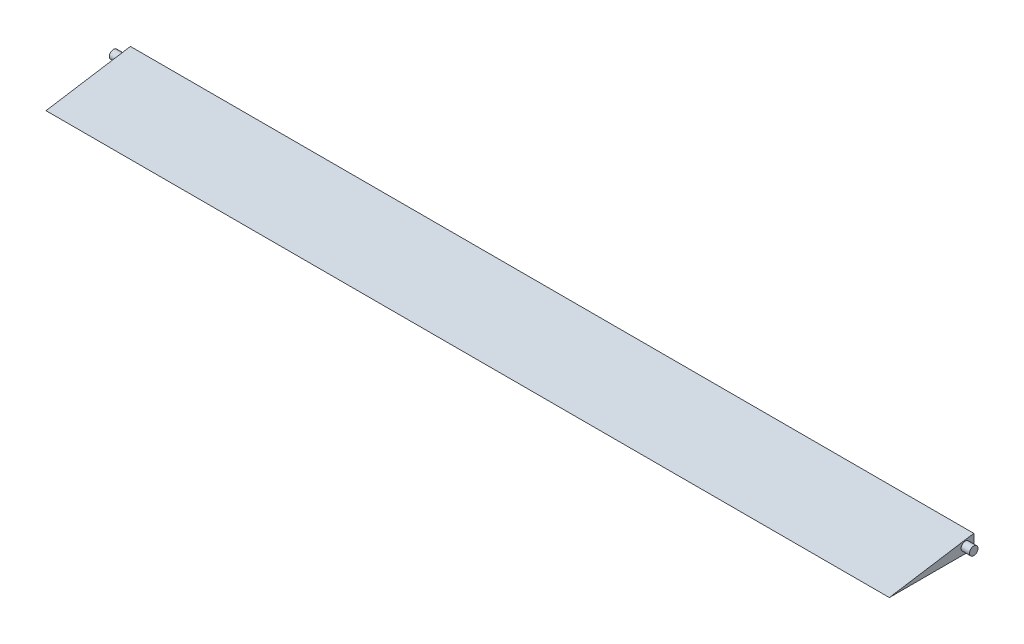
ISO-10303-21;
HEADER;
FILE_DESCRIPTION(('STEP AP214'),'2;1');
FILE_NAME('part.step','',(''),(''),'','','');
FILE_SCHEMA(('AUTOMOTIVE_DESIGN { 1 0 10303 214 1 1 1 1 }'));
ENDSEC;
DATA;
#1=APPLICATION_CONTEXT('core data for automotive mechanical design processes');
#2=APPLICATION_PROTOCOL_DEFINITION('international standard','automotive_design',2000,#1);
#3=PRODUCT_CONTEXT('',#1,'mechanical');
#4=PRODUCT('Part','Part','',(#3));
#5=PRODUCT_RELATED_PRODUCT_CATEGORY('part','',(#4));
#6=PRODUCT_DEFINITION_FORMATION('','',#4);
#7=PRODUCT_DEFINITION_CONTEXT('part definition',#1,'design');
#8=PRODUCT_DEFINITION('design','',#6,#7);
#9=PRODUCT_DEFINITION_SHAPE('','',#8);
#10=(LENGTH_UNIT() NAMED_UNIT(*) SI_UNIT(.MILLI.,.METRE.));
#11=(NAMED_UNIT(*) PLANE_ANGLE_UNIT() SI_UNIT($,.RADIAN.));
#12=(NAMED_UNIT(*) SI_UNIT($,.STERADIAN.) SOLID_ANGLE_UNIT());
#13=UNCERTAINTY_MEASURE_WITH_UNIT(LENGTH_MEASURE(1.E-05),#10,'distance_accuracy_value','');
#14=(GEOMETRIC_REPRESENTATION_CONTEXT(3) GLOBAL_UNCERTAINTY_ASSIGNED_CONTEXT((#13)) GLOBAL_UNIT_ASSIGNED_CONTEXT((#10,
#11,#12)) REPRESENTATION_CONTEXT('',''));
#15=CARTESIAN_POINT('',(0.,0.,0.));
#16=DIRECTION('',(0.,0.,1.));
#17=DIRECTION('',(1.,0.,0.));
#18=AXIS2_PLACEMENT_3D('',#15,#16,#17);
#19=CARTESIAN_POINT('',(499.5,0.,25.));
#20=DIRECTION('',(0.,-0.987563584303809,-0.157220122621166));
#21=DIRECTION('',(0.,0.157220122621166,-0.987563584303809));
#22=AXIS2_PLACEMENT_3D('',#19,#20,#21);
#23=PLANE('',#22);
#24=DIRECTION('',(0.,-0.157220122621166,0.987563584303808));
#25=VECTOR('',#24,1.);
#26=CARTESIAN_POINT('',(0.,0.,25.));
#27=LINE('',#26,#25);
#28=CARTESIAN_POINT('',(0.,7.96000000000001,-25.));
#29=VERTEX_POINT('',#28);
#30=CARTESIAN_POINT('',(0.,0.,25.));
#31=VERTEX_POINT('',#30);
#32=EDGE_CURVE('E83',#29,#31,#27,.T.);
#33=ORIENTED_EDGE('',*,*,#32,.T.);
#34=DIRECTION('',(-1.,0.,0.));
#35=VECTOR('',#34,1.);
#36=CARTESIAN_POINT('',(499.5,0.,25.));
#37=LINE('',#36,#35);
#38=CARTESIAN_POINT('',(499.5,0.,25.));
#39=VERTEX_POINT('',#38);
#40=EDGE_CURVE('E42',#39,#31,#37,.T.);
#41=ORIENTED_EDGE('',*,*,#40,.F.);
#42=DIRECTION('',(0.,-0.157220122621166,0.987563584303808));
#43=VECTOR('',#42,1.);
#44=CARTESIAN_POINT('',(499.5,0.,25.));
#45=LINE('',#44,#43);
#46=CARTESIAN_POINT('',(499.5,7.96000000000001,-25.));
#47=VERTEX_POINT('',#46);
#48=EDGE_CURVE('E76',#47,#39,#45,.T.);
#49=ORIENTED_EDGE('',*,*,#48,.F.);
#50=DIRECTION('',(-1.,0.,0.));
#51=VECTOR('',#50,1.);
#52=CARTESIAN_POINT('',(499.5,7.96000000000001,-25.));
#53=LINE('',#52,#51);
#54=EDGE_CURVE('E84',#47,#29,#53,.T.);
#55=ORIENTED_EDGE('',*,*,#54,.T.);
#56=EDGE_LOOP('',(#33,#41,#49,#55));
#57=FACE_BOUND('',#56,.T.);
#58=ADVANCED_FACE('F34',(#57),#23,.F.);
#59=CARTESIAN_POINT('',(499.5,0.,25.));
#60=DIRECTION('',(0.,1.,0.));
#61=DIRECTION('',(0.,0.,1.));
#62=AXIS2_PLACEMENT_3D('',#59,#60,#61);
#63=PLANE('',#62);
#64=DIRECTION('',(0.,0.,-1.));
#65=VECTOR('',#64,1.);
#66=CARTESIAN_POINT('',(0.,0.,25.));
#67=LINE('',#66,#65);
#68=CARTESIAN_POINT('',(0.,0.,-25.));
#69=VERTEX_POINT('',#68);
#70=EDGE_CURVE('E63',#31,#69,#67,.T.);
#71=ORIENTED_EDGE('',*,*,#70,.T.);
#72=DIRECTION('',(-1.,0.,0.));
#73=VECTOR('',#72,1.);
#74=CARTESIAN_POINT('',(499.5,0.,-25.));
#75=LINE('',#74,#73);
#76=CARTESIAN_POINT('',(499.5,0.,-25.));
#77=VERTEX_POINT('',#76);
#78=EDGE_CURVE('E75',#77,#69,#75,.T.);
#79=ORIENTED_EDGE('',*,*,#78,.F.);
#80=DIRECTION('',(0.,0.,-1.));
#81=VECTOR('',#80,1.);
#82=CARTESIAN_POINT('',(499.5,0.,25.));
#83=LINE('',#82,#81);
#84=EDGE_CURVE('E71',#39,#77,#83,.T.);
#85=ORIENTED_EDGE('',*,*,#84,.F.);
#86=ORIENTED_EDGE('',*,*,#40,.T.);
#87=EDGE_LOOP('',(#71,#79,#85,#86));
#88=FACE_BOUND('',#87,.T.);
#89=ADVANCED_FACE('F72',(#88),#63,.F.);
#90=CARTESIAN_POINT('',(499.5,0.,-25.));
#91=DIRECTION('',(0.,0.,1.));
#92=DIRECTION('',(1.,0.,0.));
#93=AXIS2_PLACEMENT_3D('',#90,#91,#92);
#94=PLANE('',#93);
#95=DIRECTION('',(0.,1.,0.));
#96=VECTOR('',#95,1.);
#97=CARTESIAN_POINT('',(0.,0.,-25.));
#98=LINE('',#97,#96);
#99=EDGE_CURVE('E68',#69,#29,#98,.T.);
#100=ORIENTED_EDGE('',*,*,#99,.T.);
#101=ORIENTED_EDGE('',*,*,#54,.F.);
#102=DIRECTION('',(0.,1.,0.));
#103=VECTOR('',#102,1.);
#104=CARTESIAN_POINT('',(499.5,0.,-25.));
#105=LINE('',#104,#103);
#106=EDGE_CURVE('E50',#77,#47,#105,.T.);
#107=ORIENTED_EDGE('',*,*,#106,.F.);
#108=ORIENTED_EDGE('',*,*,#78,.T.);
#109=EDGE_LOOP('',(#100,#101,#107,#108));
#110=FACE_BOUND('',#109,.T.);
#111=ADVANCED_FACE('F122',(#110),#94,.F.);
#112=CARTESIAN_POINT('',(499.5,0.,0.));
#113=DIRECTION('',(1.,0.,0.));
#114=DIRECTION('',(0.,0.,-1.));
#115=AXIS2_PLACEMENT_3D('',#112,#113,#114);
#116=PLANE('',#115);
#117=CARTESIAN_POINT('',(499.5,3.98000000000001,-20.));
#118=DIRECTION('',(1.,0.,0.));
#119=DIRECTION('',(0.,0.,-1.));
#120=AXIS2_PLACEMENT_3D('',#117,#118,#119);
#121=CIRCLE('',#120,2.5);
#122=CARTESIAN_POINT('',(499.5,3.98000000000001,-22.5));
#123=VERTEX_POINT('',#122);
#124=EDGE_CURVE('E93',#123,#123,#121,.T.);
#125=ORIENTED_EDGE('',*,*,#124,.F.);
#126=EDGE_LOOP('',(#125));
#127=FACE_BOUND('',#126,.T.);
#128=ORIENTED_EDGE('',*,*,#48,.T.);
#129=ORIENTED_EDGE('',*,*,#84,.T.);
#130=ORIENTED_EDGE('',*,*,#106,.T.);
#131=EDGE_LOOP('',(#128,#129,#130));
#132=FACE_BOUND('',#131,.T.);
#133=ADVANCED_FACE('F79',(#127,#132),#116,.T.);
#134=CARTESIAN_POINT('',(0.,0.,0.));
#135=DIRECTION('',(1.,0.,0.));
#136=DIRECTION('',(0.,0.,-1.));
#137=AXIS2_PLACEMENT_3D('',#134,#135,#136);
#138=PLANE('',#137);
#139=CARTESIAN_POINT('',(0.,3.98000000000001,-20.));
#140=DIRECTION('',(1.,0.,0.));
#141=DIRECTION('',(0.,0.,-1.));
#142=AXIS2_PLACEMENT_3D('',#139,#140,#141);
#143=CIRCLE('',#142,2.5);
#144=CARTESIAN_POINT('',(0.,3.98000000000001,-22.5));
#145=VERTEX_POINT('',#144);
#146=EDGE_CURVE('E11',#145,#145,#143,.F.);
#147=ORIENTED_EDGE('',*,*,#146,.F.);
#148=EDGE_LOOP('',(#147));
#149=FACE_BOUND('',#148,.T.);
#150=ORIENTED_EDGE('',*,*,#32,.F.);
#151=ORIENTED_EDGE('',*,*,#99,.F.);
#152=ORIENTED_EDGE('',*,*,#70,.F.);
#153=EDGE_LOOP('',(#150,#151,#152));
#154=FACE_BOUND('',#153,.T.);
#155=ADVANCED_FACE('F111',(#149,#154),#138,.F.);
#156=CARTESIAN_POINT('',(504.5,3.98000000000001,-20.));
#157=DIRECTION('',(-1.,0.,0.));
#158=DIRECTION('',(0.,0.,1.));
#159=AXIS2_PLACEMENT_3D('',#156,#157,#158);
#160=CYLINDRICAL_SURFACE('',#159,2.5);
#161=CARTESIAN_POINT('',(504.5,3.98000000000001,-20.));
#162=DIRECTION('',(1.,0.,0.));
#163=DIRECTION('',(0.,0.,-1.));
#164=AXIS2_PLACEMENT_3D('',#161,#162,#163);
#165=CIRCLE('',#164,2.5);
#166=CARTESIAN_POINT('',(504.5,3.98000000000001,-22.5));
#167=VERTEX_POINT('',#166);
#168=EDGE_CURVE('E91',#167,#167,#165,.T.);
#169=ORIENTED_EDGE('',*,*,#168,.F.);
#170=EDGE_LOOP('',(#169));
#171=FACE_BOUND('',#170,.T.);
#172=ORIENTED_EDGE('',*,*,#124,.T.);
#173=EDGE_LOOP('',(#172));
#174=FACE_BOUND('',#173,.T.);
#175=ADVANCED_FACE('F114',(#171,#174),#160,.T.);
#176=CARTESIAN_POINT('',(504.5,3.98000000000001,-20.));
#177=DIRECTION('',(1.,0.,0.));
#178=DIRECTION('',(0.,0.,-1.));
#179=AXIS2_PLACEMENT_3D('',#176,#177,#178);
#180=PLANE('',#179);
#181=ORIENTED_EDGE('',*,*,#168,.T.);
#182=EDGE_LOOP('',(#181));
#183=FACE_BOUND('',#182,.T.);
#184=ADVANCED_FACE('F107',(#183),#180,.T.);
#185=CARTESIAN_POINT('',(-5.,3.98000000000001,-20.));
#186=DIRECTION('',(1.,0.,0.));
#187=DIRECTION('',(0.,0.,-1.));
#188=AXIS2_PLACEMENT_3D('',#185,#186,#187);
#189=CYLINDRICAL_SURFACE('',#188,2.5);
#190=CARTESIAN_POINT('',(-5.,3.98000000000001,-20.));
#191=DIRECTION('',(-1.,0.,0.));
#192=DIRECTION('',(0.,0.,1.));
#193=AXIS2_PLACEMENT_3D('',#190,#191,#192);
#194=CIRCLE('',#193,2.5);
#195=CARTESIAN_POINT('',(-5.,3.98000000000001,-17.5));
#196=VERTEX_POINT('',#195);
#197=EDGE_CURVE('E96',#196,#196,#194,.T.);
#198=ORIENTED_EDGE('',*,*,#197,.F.);
#199=EDGE_LOOP('',(#198));
#200=FACE_BOUND('',#199,.T.);
#201=ORIENTED_EDGE('',*,*,#146,.T.);
#202=EDGE_LOOP('',(#201));
#203=FACE_BOUND('',#202,.T.);
#204=ADVANCED_FACE('F104',(#200,#203),#189,.T.);
#205=CARTESIAN_POINT('',(-5.,3.98000000000001,-20.));
#206=DIRECTION('',(-1.,0.,0.));
#207=DIRECTION('',(0.,0.,1.));
#208=AXIS2_PLACEMENT_3D('',#205,#206,#207);
#209=PLANE('',#208);
#210=ORIENTED_EDGE('',*,*,#197,.T.);
#211=EDGE_LOOP('',(#210));
#212=FACE_BOUND('',#211,.T.);
#213=ADVANCED_FACE('F102',(#212),#209,.T.);
#214=CLOSED_SHELL('',(#58,#89,#111,#133,#155,#175,#184,#204,#213));
#215=MANIFOLD_SOLID_BREP('B2',#214);
#216=ADVANCED_BREP_SHAPE_REPRESENTATION('',(#18,#215),#14);
#217=SHAPE_DEFINITION_REPRESENTATION(#9,#216);
ENDSEC;
END-ISO-10303-21;
